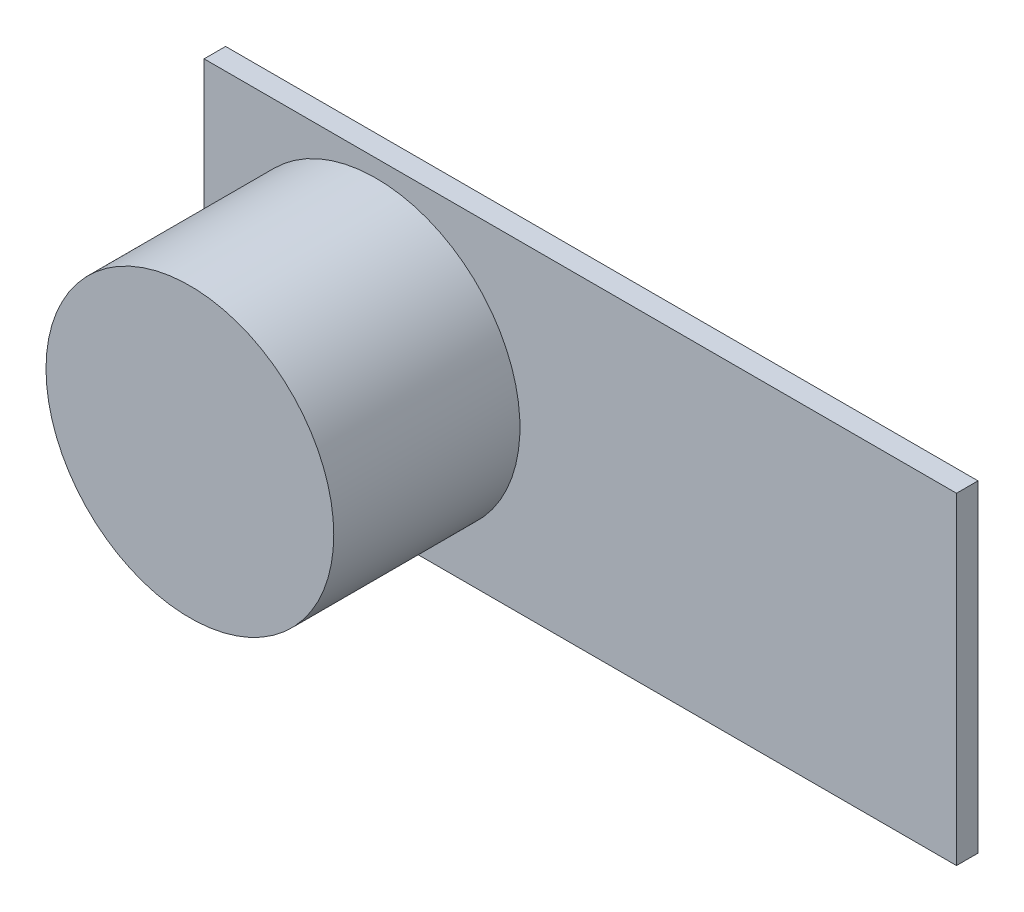
ISO-10303-21;
HEADER;
FILE_DESCRIPTION(('STEP AP214'),'2;1');
FILE_NAME('part.step','',(''),(''),'','','');
FILE_SCHEMA(('AUTOMOTIVE_DESIGN { 1 0 10303 214 1 1 1 1 }'));
ENDSEC;
DATA;
#1=APPLICATION_CONTEXT('core data for automotive mechanical design processes');
#2=APPLICATION_PROTOCOL_DEFINITION('international standard','automotive_design',2000,#1);
#3=PRODUCT_CONTEXT('',#1,'mechanical');
#4=PRODUCT('Part','Part','',(#3));
#5=PRODUCT_RELATED_PRODUCT_CATEGORY('part','',(#4));
#6=PRODUCT_DEFINITION_FORMATION('','',#4);
#7=PRODUCT_DEFINITION_CONTEXT('part definition',#1,'design');
#8=PRODUCT_DEFINITION('design','',#6,#7);
#9=PRODUCT_DEFINITION_SHAPE('','',#8);
#10=(LENGTH_UNIT() NAMED_UNIT(*) SI_UNIT(.MILLI.,.METRE.));
#11=(NAMED_UNIT(*) PLANE_ANGLE_UNIT() SI_UNIT($,.RADIAN.));
#12=(NAMED_UNIT(*) SI_UNIT($,.STERADIAN.) SOLID_ANGLE_UNIT());
#13=UNCERTAINTY_MEASURE_WITH_UNIT(LENGTH_MEASURE(1.E-05),#10,'distance_accuracy_value','');
#14=(GEOMETRIC_REPRESENTATION_CONTEXT(3) GLOBAL_UNCERTAINTY_ASSIGNED_CONTEXT((#13)) GLOBAL_UNIT_ASSIGNED_CONTEXT((#10,
#11,#12)) REPRESENTATION_CONTEXT('',''));
#15=CARTESIAN_POINT('',(0.,0.,0.));
#16=DIRECTION('',(0.,0.,1.));
#17=DIRECTION('',(1.,0.,0.));
#18=AXIS2_PLACEMENT_3D('',#15,#16,#17);
#19=CARTESIAN_POINT('',(0.,0.,1.27));
#20=DIRECTION('',(1.,0.,0.));
#21=DIRECTION('',(0.,0.,-1.));
#22=AXIS2_PLACEMENT_3D('',#19,#20,#21);
#23=PLANE('',#22);
#24=DIRECTION('',(0.,-1.,0.));
#25=VECTOR('',#24,1.);
#26=CARTESIAN_POINT('',(0.,0.,0.));
#27=LINE('',#26,#25);
#28=CARTESIAN_POINT('',(0.,19.05,0.));
#29=VERTEX_POINT('',#28);
#30=CARTESIAN_POINT('',(0.,0.,0.));
#31=VERTEX_POINT('',#30);
#32=EDGE_CURVE('E99',#29,#31,#27,.T.);
#33=ORIENTED_EDGE('',*,*,#32,.T.);
#34=DIRECTION('',(0.,0.,-1.));
#35=VECTOR('',#34,1.);
#36=CARTESIAN_POINT('',(0.,0.,1.27));
#37=LINE('',#36,#35);
#38=CARTESIAN_POINT('',(0.,0.,1.27));
#39=VERTEX_POINT('',#38);
#40=EDGE_CURVE('E41',#39,#31,#37,.T.);
#41=ORIENTED_EDGE('',*,*,#40,.F.);
#42=DIRECTION('',(0.,-1.,0.));
#43=VECTOR('',#42,1.);
#44=CARTESIAN_POINT('',(0.,0.,1.27));
#45=LINE('',#44,#43);
#46=CARTESIAN_POINT('',(0.,19.05,1.27));
#47=VERTEX_POINT('',#46);
#48=EDGE_CURVE('E85',#47,#39,#45,.T.);
#49=ORIENTED_EDGE('',*,*,#48,.F.);
#50=DIRECTION('',(0.,0.,-1.));
#51=VECTOR('',#50,1.);
#52=CARTESIAN_POINT('',(0.,19.05,1.27));
#53=LINE('',#52,#51);
#54=EDGE_CURVE('E95',#47,#29,#53,.T.);
#55=ORIENTED_EDGE('',*,*,#54,.T.);
#56=EDGE_LOOP('',(#33,#41,#49,#55));
#57=FACE_BOUND('',#56,.T.);
#58=ADVANCED_FACE('F33',(#57),#23,.F.);
#59=CARTESIAN_POINT('',(0.,0.,1.27));
#60=DIRECTION('',(0.,1.,0.));
#61=DIRECTION('',(0.,0.,1.));
#62=AXIS2_PLACEMENT_3D('',#59,#60,#61);
#63=PLANE('',#62);
#64=DIRECTION('',(1.,0.,0.));
#65=VECTOR('',#64,1.);
#66=CARTESIAN_POINT('',(0.,0.,0.));
#67=LINE('',#66,#65);
#68=CARTESIAN_POINT('',(44.45,0.,0.));
#69=VERTEX_POINT('',#68);
#70=EDGE_CURVE('E90',#31,#69,#67,.T.);
#71=ORIENTED_EDGE('',*,*,#70,.T.);
#72=DIRECTION('',(0.,0.,-1.));
#73=VECTOR('',#72,1.);
#74=CARTESIAN_POINT('',(44.45,0.,1.27));
#75=LINE('',#74,#73);
#76=CARTESIAN_POINT('',(44.45,0.,1.27));
#77=VERTEX_POINT('',#76);
#78=EDGE_CURVE('E88',#77,#69,#75,.T.);
#79=ORIENTED_EDGE('',*,*,#78,.F.);
#80=DIRECTION('',(1.,0.,0.));
#81=VECTOR('',#80,1.);
#82=CARTESIAN_POINT('',(0.,0.,1.27));
#83=LINE('',#82,#81);
#84=EDGE_CURVE('E80',#39,#77,#83,.T.);
#85=ORIENTED_EDGE('',*,*,#84,.F.);
#86=ORIENTED_EDGE('',*,*,#40,.T.);
#87=EDGE_LOOP('',(#71,#79,#85,#86));
#88=FACE_BOUND('',#87,.T.);
#89=ADVANCED_FACE('F89',(#88),#63,.F.);
#90=CARTESIAN_POINT('',(44.45,0.,1.27));
#91=DIRECTION('',(-1.,0.,0.));
#92=DIRECTION('',(0.,0.,1.));
#93=AXIS2_PLACEMENT_3D('',#90,#91,#92);
#94=PLANE('',#93);
#95=DIRECTION('',(0.,1.,0.));
#96=VECTOR('',#95,1.);
#97=CARTESIAN_POINT('',(44.45,0.,0.));
#98=LINE('',#97,#96);
#99=CARTESIAN_POINT('',(44.45,19.05,0.));
#100=VERTEX_POINT('',#99);
#101=EDGE_CURVE('E66',#69,#100,#98,.T.);
#102=ORIENTED_EDGE('',*,*,#101,.T.);
#103=DIRECTION('',(0.,0.,-1.));
#104=VECTOR('',#103,1.);
#105=CARTESIAN_POINT('',(44.45,19.05,1.27));
#106=LINE('',#105,#104);
#107=CARTESIAN_POINT('',(44.45,19.05,1.27));
#108=VERTEX_POINT('',#107);
#109=EDGE_CURVE('E91',#108,#100,#106,.T.);
#110=ORIENTED_EDGE('',*,*,#109,.F.);
#111=DIRECTION('',(0.,1.,0.));
#112=VECTOR('',#111,1.);
#113=CARTESIAN_POINT('',(44.45,0.,1.27));
#114=LINE('',#113,#112);
#115=EDGE_CURVE('E83',#77,#108,#114,.T.);
#116=ORIENTED_EDGE('',*,*,#115,.F.);
#117=ORIENTED_EDGE('',*,*,#78,.T.);
#118=EDGE_LOOP('',(#102,#110,#116,#117));
#119=FACE_BOUND('',#118,.T.);
#120=ADVANCED_FACE('F93',(#119),#94,.F.);
#121=CARTESIAN_POINT('',(0.,19.05,1.27));
#122=DIRECTION('',(0.,-1.,0.));
#123=DIRECTION('',(0.,0.,-1.));
#124=AXIS2_PLACEMENT_3D('',#121,#122,#123);
#125=PLANE('',#124);
#126=DIRECTION('',(-1.,0.,0.));
#127=VECTOR('',#126,1.);
#128=CARTESIAN_POINT('',(0.,19.05,0.));
#129=LINE('',#128,#127);
#130=EDGE_CURVE('E72',#100,#29,#129,.T.);
#131=ORIENTED_EDGE('',*,*,#130,.T.);
#132=ORIENTED_EDGE('',*,*,#54,.F.);
#133=DIRECTION('',(-1.,0.,0.));
#134=VECTOR('',#133,1.);
#135=CARTESIAN_POINT('',(0.,19.05,1.27));
#136=LINE('',#135,#134);
#137=EDGE_CURVE('E49',#108,#47,#136,.T.);
#138=ORIENTED_EDGE('',*,*,#137,.F.);
#139=ORIENTED_EDGE('',*,*,#109,.T.);
#140=EDGE_LOOP('',(#131,#132,#138,#139));
#141=FACE_BOUND('',#140,.T.);
#142=ADVANCED_FACE('F121',(#141),#125,.F.);
#143=CARTESIAN_POINT('',(0.,0.,1.27));
#144=DIRECTION('',(0.,0.,-1.));
#145=DIRECTION('',(-1.,0.,0.));
#146=AXIS2_PLACEMENT_3D('',#143,#144,#145);
#147=PLANE('',#146);
#148=CARTESIAN_POINT('',(10.16,9.525,1.27));
#149=DIRECTION('',(0.,0.,-1.));
#150=DIRECTION('',(-1.,0.,0.));
#151=AXIS2_PLACEMENT_3D('',#148,#149,#150);
#152=CIRCLE('',#151,8.5);
#153=CARTESIAN_POINT('',(1.66000000000001,9.525,1.27));
#154=VERTEX_POINT('',#153);
#155=EDGE_CURVE('E11',#154,#154,#152,.F.);
#156=ORIENTED_EDGE('',*,*,#155,.F.);
#157=EDGE_LOOP('',(#156));
#158=FACE_BOUND('',#157,.T.);
#159=ORIENTED_EDGE('',*,*,#48,.T.);
#160=ORIENTED_EDGE('',*,*,#84,.T.);
#161=ORIENTED_EDGE('',*,*,#115,.T.);
#162=ORIENTED_EDGE('',*,*,#137,.T.);
#163=EDGE_LOOP('',(#159,#160,#161,#162));
#164=FACE_BOUND('',#163,.T.);
#165=ADVANCED_FACE('F81',(#158,#164),#147,.F.);
#166=CARTESIAN_POINT('',(0.,0.,0.));
#167=DIRECTION('',(0.,0.,-1.));
#168=DIRECTION('',(-1.,0.,0.));
#169=AXIS2_PLACEMENT_3D('',#166,#167,#168);
#170=PLANE('',#169);
#171=ORIENTED_EDGE('',*,*,#32,.F.);
#172=ORIENTED_EDGE('',*,*,#130,.F.);
#173=ORIENTED_EDGE('',*,*,#101,.F.);
#174=ORIENTED_EDGE('',*,*,#70,.F.);
#175=EDGE_LOOP('',(#171,#172,#173,#174));
#176=FACE_BOUND('',#175,.T.);
#177=ADVANCED_FACE('F110',(#176),#170,.T.);
#178=CARTESIAN_POINT('',(10.16,9.525,12.27));
#179=DIRECTION('',(0.,0.,-1.));
#180=DIRECTION('',(-1.,0.,0.));
#181=AXIS2_PLACEMENT_3D('',#178,#179,#180);
#182=CYLINDRICAL_SURFACE('',#181,8.5);
#183=CARTESIAN_POINT('',(10.16,9.525,12.27));
#184=DIRECTION('',(0.,0.,1.));
#185=DIRECTION('',(1.,0.,0.));
#186=AXIS2_PLACEMENT_3D('',#183,#184,#185);
#187=CIRCLE('',#186,8.5);
#188=CARTESIAN_POINT('',(18.66,9.525,12.27));
#189=VERTEX_POINT('',#188);
#190=EDGE_CURVE('E102',#189,#189,#187,.T.);
#191=ORIENTED_EDGE('',*,*,#190,.F.);
#192=EDGE_LOOP('',(#191));
#193=FACE_BOUND('',#192,.T.);
#194=ORIENTED_EDGE('',*,*,#155,.T.);
#195=EDGE_LOOP('',(#194));
#196=FACE_BOUND('',#195,.T.);
#197=ADVANCED_FACE('F112',(#193,#196),#182,.T.);
#198=CARTESIAN_POINT('',(10.16,9.525,12.27));
#199=DIRECTION('',(0.,0.,1.));
#200=DIRECTION('',(1.,0.,0.));
#201=AXIS2_PLACEMENT_3D('',#198,#199,#200);
#202=PLANE('',#201);
#203=ORIENTED_EDGE('',*,*,#190,.T.);
#204=EDGE_LOOP('',(#203));
#205=FACE_BOUND('',#204,.T.);
#206=ADVANCED_FACE('F118',(#205),#202,.T.);
#207=CLOSED_SHELL('',(#58,#89,#120,#142,#165,#177,#197,#206));
#208=MANIFOLD_SOLID_BREP('B2',#207);
#209=ADVANCED_BREP_SHAPE_REPRESENTATION('',(#18,#208),#14);
#210=SHAPE_DEFINITION_REPRESENTATION(#9,#209);
ENDSEC;
END-ISO-10303-21;
